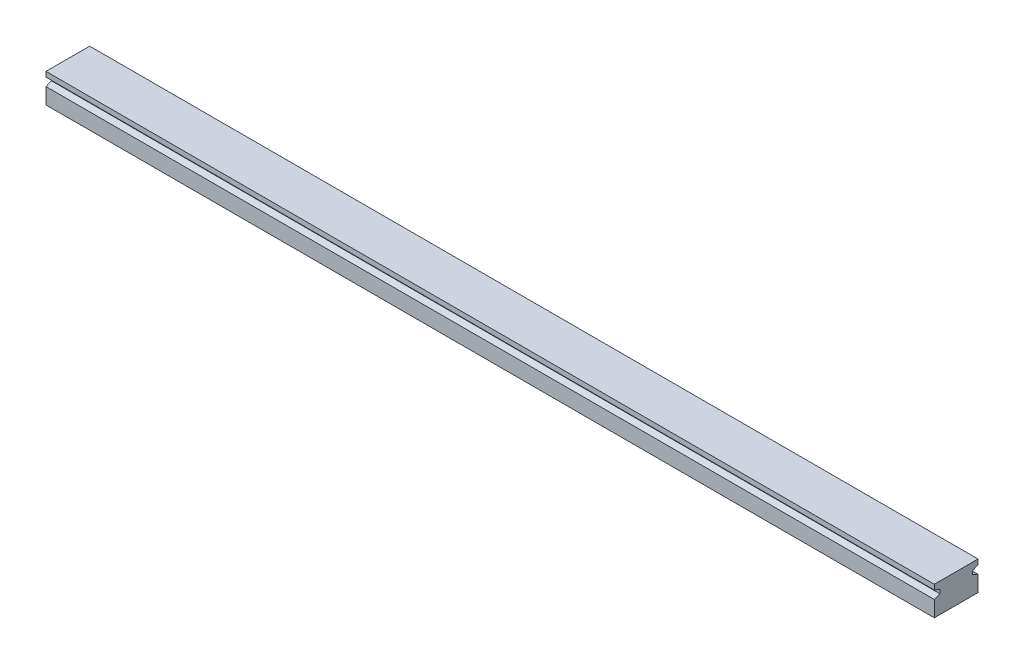
ISO-10303-21;
HEADER;
FILE_DESCRIPTION(('STEP AP214'),'2;1');
FILE_NAME('part.step','',(''),(''),'','','');
FILE_SCHEMA(('AUTOMOTIVE_DESIGN { 1 0 10303 214 1 1 1 1 }'));
ENDSEC;
DATA;
#1=APPLICATION_CONTEXT('core data for automotive mechanical design processes');
#2=APPLICATION_PROTOCOL_DEFINITION('international standard','automotive_design',2000,#1);
#3=PRODUCT_CONTEXT('',#1,'mechanical');
#4=PRODUCT('Part','Part','',(#3));
#5=PRODUCT_RELATED_PRODUCT_CATEGORY('part','',(#4));
#6=PRODUCT_DEFINITION_FORMATION('','',#4);
#7=PRODUCT_DEFINITION_CONTEXT('part definition',#1,'design');
#8=PRODUCT_DEFINITION('design','',#6,#7);
#9=PRODUCT_DEFINITION_SHAPE('','',#8);
#10=(LENGTH_UNIT() NAMED_UNIT(*) SI_UNIT(.MILLI.,.METRE.));
#11=(NAMED_UNIT(*) PLANE_ANGLE_UNIT() SI_UNIT($,.RADIAN.));
#12=(NAMED_UNIT(*) SI_UNIT($,.STERADIAN.) SOLID_ANGLE_UNIT());
#13=UNCERTAINTY_MEASURE_WITH_UNIT(LENGTH_MEASURE(1.E-05),#10,'distance_accuracy_value','');
#14=(GEOMETRIC_REPRESENTATION_CONTEXT(3) GLOBAL_UNCERTAINTY_ASSIGNED_CONTEXT((#13)) GLOBAL_UNIT_ASSIGNED_CONTEXT((#10,
#11,#12)) REPRESENTATION_CONTEXT('',''));
#15=CARTESIAN_POINT('',(0.,0.,0.));
#16=DIRECTION('',(0.,0.,1.));
#17=DIRECTION('',(1.,0.,0.));
#18=AXIS2_PLACEMENT_3D('',#15,#16,#17);
#19=CARTESIAN_POINT('',(-140.,4.,-6.));
#20=DIRECTION('',(0.,0.,1.));
#21=DIRECTION('',(1.,0.,0.));
#22=AXIS2_PLACEMENT_3D('',#19,#20,#21);
#23=PLANE('',#22);
#24=DIRECTION('',(0.,1.,0.));
#25=VECTOR('',#24,1.);
#26=CARTESIAN_POINT('',(122.,-4.,-6.));
#27=LINE('',#26,#25);
#28=CARTESIAN_POINT('',(122.,2.625,-6.));
#29=VERTEX_POINT('',#28);
#30=CARTESIAN_POINT('',(122.,4.,-6.));
#31=VERTEX_POINT('',#30);
#32=EDGE_CURVE('E143',#29,#31,#27,.T.);
#33=ORIENTED_EDGE('',*,*,#32,.F.);
#34=DIRECTION('',(-1.,0.,0.));
#35=VECTOR('',#34,1.);
#36=CARTESIAN_POINT('',(140.,2.625,-6.));
#37=LINE('',#36,#35);
#38=CARTESIAN_POINT('',(-122.,2.625,-6.));
#39=VERTEX_POINT('',#38);
#40=EDGE_CURVE('E220',#29,#39,#37,.T.);
#41=ORIENTED_EDGE('',*,*,#40,.T.);
#42=DIRECTION('',(0.,1.,0.));
#43=VECTOR('',#42,1.);
#44=CARTESIAN_POINT('',(-122.,-4.,-6.));
#45=LINE('',#44,#43);
#46=CARTESIAN_POINT('',(-122.,4.,-6.));
#47=VERTEX_POINT('',#46);
#48=EDGE_CURVE('E289',#39,#47,#45,.T.);
#49=ORIENTED_EDGE('',*,*,#48,.T.);
#50=DIRECTION('',(-1.,0.,0.));
#51=VECTOR('',#50,1.);
#52=CARTESIAN_POINT('',(-140.,4.,-6.));
#53=LINE('',#52,#51);
#54=EDGE_CURVE('E165',#31,#47,#53,.T.);
#55=ORIENTED_EDGE('',*,*,#54,.F.);
#56=EDGE_LOOP('',(#33,#41,#49,#55));
#57=FACE_BOUND('',#56,.T.);
#58=ADVANCED_FACE('F45',(#57),#23,.F.);
#59=CARTESIAN_POINT('',(-140.,4.,6.));
#60=DIRECTION('',(0.,0.,-1.));
#61=DIRECTION('',(-1.,0.,0.));
#62=AXIS2_PLACEMENT_3D('',#59,#60,#61);
#63=PLANE('',#62);
#64=DIRECTION('',(0.,1.,0.));
#65=VECTOR('',#64,1.);
#66=CARTESIAN_POINT('',(122.,-4.,6.));
#67=LINE('',#66,#65);
#68=CARTESIAN_POINT('',(122.,2.625,6.));
#69=VERTEX_POINT('',#68);
#70=CARTESIAN_POINT('',(122.,4.,6.));
#71=VERTEX_POINT('',#70);
#72=EDGE_CURVE('E154',#69,#71,#67,.T.);
#73=ORIENTED_EDGE('',*,*,#72,.T.);
#74=DIRECTION('',(1.,0.,0.));
#75=VECTOR('',#74,1.);
#76=CARTESIAN_POINT('',(-140.,4.,6.));
#77=LINE('',#76,#75);
#78=CARTESIAN_POINT('',(-122.,4.,6.));
#79=VERTEX_POINT('',#78);
#80=EDGE_CURVE('E171',#79,#71,#77,.T.);
#81=ORIENTED_EDGE('',*,*,#80,.F.);
#82=DIRECTION('',(0.,1.,0.));
#83=VECTOR('',#82,1.);
#84=CARTESIAN_POINT('',(-122.,-4.,6.));
#85=LINE('',#84,#83);
#86=CARTESIAN_POINT('',(-122.,2.625,6.));
#87=VERTEX_POINT('',#86);
#88=EDGE_CURVE('E260',#87,#79,#85,.T.);
#89=ORIENTED_EDGE('',*,*,#88,.F.);
#90=DIRECTION('',(-1.,0.,0.));
#91=VECTOR('',#90,1.);
#92=CARTESIAN_POINT('',(140.,2.625,6.));
#93=LINE('',#92,#91);
#94=EDGE_CURVE('E249',#69,#87,#93,.T.);
#95=ORIENTED_EDGE('',*,*,#94,.F.);
#96=EDGE_LOOP('',(#73,#81,#89,#95));
#97=FACE_BOUND('',#96,.T.);
#98=ADVANCED_FACE('F205',(#97),#63,.F.);
#99=CARTESIAN_POINT('',(0.,4.,0.));
#100=DIRECTION('',(0.,-1.,0.));
#101=DIRECTION('',(0.,0.,-1.));
#102=AXIS2_PLACEMENT_3D('',#99,#100,#101);
#103=PLANE('',#102);
#104=DIRECTION('',(0.,0.,-1.));
#105=VECTOR('',#104,1.);
#106=CARTESIAN_POINT('',(122.,4.,-6.));
#107=LINE('',#106,#105);
#108=EDGE_CURVE('E144',#71,#31,#107,.T.);
#109=ORIENTED_EDGE('',*,*,#108,.T.);
#110=ORIENTED_EDGE('',*,*,#54,.T.);
#111=DIRECTION('',(0.,0.,-1.));
#112=VECTOR('',#111,1.);
#113=CARTESIAN_POINT('',(-122.,4.,-6.));
#114=LINE('',#113,#112);
#115=EDGE_CURVE('E256',#79,#47,#114,.T.);
#116=ORIENTED_EDGE('',*,*,#115,.F.);
#117=ORIENTED_EDGE('',*,*,#80,.T.);
#118=EDGE_LOOP('',(#109,#110,#116,#117));
#119=FACE_BOUND('',#118,.T.);
#120=ADVANCED_FACE('F196',(#119),#103,.F.);
#121=CARTESIAN_POINT('',(0.,-4.,0.));
#122=DIRECTION('',(0.,-1.,0.));
#123=DIRECTION('',(0.,0.,-1.));
#124=AXIS2_PLACEMENT_3D('',#121,#122,#123);
#125=PLANE('',#124);
#126=CARTESIAN_POINT('',(25.,-4.,0.));
#127=DIRECTION('',(0.,1.,0.));
#128=DIRECTION('',(0.,0.,1.));
#129=AXIS2_PLACEMENT_3D('',#126,#127,#128);
#130=CIRCLE('',#129,2.);
#131=CARTESIAN_POINT('',(25.,-4.,2.));
#132=VERTEX_POINT('',#131);
#133=EDGE_CURVE('E168',#132,#132,#130,.T.);
#134=ORIENTED_EDGE('',*,*,#133,.T.);
#135=EDGE_LOOP('',(#134));
#136=FACE_BOUND('',#135,.T.);
#137=CARTESIAN_POINT('',(-25.,-4.,0.));
#138=DIRECTION('',(0.,1.,0.));
#139=DIRECTION('',(0.,0.,1.));
#140=AXIS2_PLACEMENT_3D('',#137,#138,#139);
#141=CIRCLE('',#140,2.);
#142=CARTESIAN_POINT('',(-25.,-4.,2.));
#143=VERTEX_POINT('',#142);
#144=EDGE_CURVE('E161',#143,#143,#141,.T.);
#145=ORIENTED_EDGE('',*,*,#144,.T.);
#146=EDGE_LOOP('',(#145));
#147=FACE_BOUND('',#146,.T.);
#148=DIRECTION('',(-1.,0.,0.));
#149=VECTOR('',#148,1.);
#150=CARTESIAN_POINT('',(-140.,-4.,-6.));
#151=LINE('',#150,#149);
#152=CARTESIAN_POINT('',(122.,-4.,-6.));
#153=VERTEX_POINT('',#152);
#154=CARTESIAN_POINT('',(-122.,-4.,-6.));
#155=VERTEX_POINT('',#154);
#156=EDGE_CURVE('E150',#153,#155,#151,.T.);
#157=ORIENTED_EDGE('',*,*,#156,.F.);
#158=DIRECTION('',(0.,0.,-1.));
#159=VECTOR('',#158,1.);
#160=CARTESIAN_POINT('',(122.,-4.,-6.));
#161=LINE('',#160,#159);
#162=CARTESIAN_POINT('',(122.,-4.,6.));
#163=VERTEX_POINT('',#162);
#164=EDGE_CURVE('E134',#163,#153,#161,.T.);
#165=ORIENTED_EDGE('',*,*,#164,.F.);
#166=DIRECTION('',(1.,0.,0.));
#167=VECTOR('',#166,1.);
#168=CARTESIAN_POINT('',(-140.,-4.,6.));
#169=LINE('',#168,#167);
#170=CARTESIAN_POINT('',(-122.,-4.,6.));
#171=VERTEX_POINT('',#170);
#172=EDGE_CURVE('E160',#171,#163,#169,.T.);
#173=ORIENTED_EDGE('',*,*,#172,.F.);
#174=DIRECTION('',(0.,0.,-1.));
#175=VECTOR('',#174,1.);
#176=CARTESIAN_POINT('',(-122.,-4.,-6.));
#177=LINE('',#176,#175);
#178=EDGE_CURVE('E158',#171,#155,#177,.T.);
#179=ORIENTED_EDGE('',*,*,#178,.T.);
#180=EDGE_LOOP('',(#157,#165,#173,#179));
#181=FACE_BOUND('',#180,.T.);
#182=ADVANCED_FACE('F157',(#136,#147,#181),#125,.T.);
#183=CARTESIAN_POINT('',(122.,0.374999999999999,-6.));
#184=VERTEX_POINT('',#183);
#185=EDGE_CURVE('E60',#153,#184,#27,.T.);
#186=ORIENTED_EDGE('',*,*,#185,.F.);
#187=ORIENTED_EDGE('',*,*,#156,.T.);
#188=CARTESIAN_POINT('',(-122.,0.374999999999999,-6.));
#189=VERTEX_POINT('',#188);
#190=EDGE_CURVE('E285',#155,#189,#45,.T.);
#191=ORIENTED_EDGE('',*,*,#190,.T.);
#192=DIRECTION('',(-1.,0.,0.));
#193=VECTOR('',#192,1.);
#194=CARTESIAN_POINT('',(140.,0.374999999999999,-6.));
#195=LINE('',#194,#193);
#196=EDGE_CURVE('E152',#184,#189,#195,.T.);
#197=ORIENTED_EDGE('',*,*,#196,.F.);
#198=EDGE_LOOP('',(#186,#187,#191,#197));
#199=FACE_BOUND('',#198,.T.);
#200=ADVANCED_FACE('F148',(#199),#23,.F.);
#201=CARTESIAN_POINT('',(122.,0.374999999999998,6.));
#202=VERTEX_POINT('',#201);
#203=EDGE_CURVE('E137',#163,#202,#67,.T.);
#204=ORIENTED_EDGE('',*,*,#203,.T.);
#205=DIRECTION('',(-1.,0.,0.));
#206=VECTOR('',#205,1.);
#207=CARTESIAN_POINT('',(140.,0.374999999999999,6.));
#208=LINE('',#207,#206);
#209=CARTESIAN_POINT('',(-122.,0.374999999999999,6.));
#210=VERTEX_POINT('',#209);
#211=EDGE_CURVE('E311',#202,#210,#208,.T.);
#212=ORIENTED_EDGE('',*,*,#211,.T.);
#213=EDGE_CURVE('E290',#171,#210,#85,.T.);
#214=ORIENTED_EDGE('',*,*,#213,.F.);
#215=ORIENTED_EDGE('',*,*,#172,.T.);
#216=EDGE_LOOP('',(#204,#212,#214,#215));
#217=FACE_BOUND('',#216,.T.);
#218=ADVANCED_FACE('F204',(#217),#63,.F.);
#219=CARTESIAN_POINT('',(140.,2.,4.5));
#220=DIRECTION('',(0.,0.923076923076923,-0.384615384615385));
#221=DIRECTION('',(0.,0.384615384615385,0.923076923076923));
#222=AXIS2_PLACEMENT_3D('',#219,#220,#221);
#223=PLANE('',#222);
#224=DIRECTION('',(0.,-0.384615384615385,-0.923076923076923));
#225=VECTOR('',#224,1.);
#226=CARTESIAN_POINT('',(122.,2.,4.5));
#227=LINE('',#226,#225);
#228=CARTESIAN_POINT('',(122.,2.,4.5));
#229=VERTEX_POINT('',#228);
#230=EDGE_CURVE('E278',#69,#229,#227,.T.);
#231=ORIENTED_EDGE('',*,*,#230,.F.);
#232=ORIENTED_EDGE('',*,*,#94,.T.);
#233=DIRECTION('',(0.,-0.384615384615385,-0.923076923076923));
#234=VECTOR('',#233,1.);
#235=CARTESIAN_POINT('',(-122.,2.,4.5));
#236=LINE('',#235,#234);
#237=CARTESIAN_POINT('',(-122.,2.,4.5));
#238=VERTEX_POINT('',#237);
#239=EDGE_CURVE('E247',#87,#238,#236,.T.);
#240=ORIENTED_EDGE('',*,*,#239,.T.);
#241=DIRECTION('',(-1.,0.,0.));
#242=VECTOR('',#241,1.);
#243=CARTESIAN_POINT('',(140.,2.,4.5));
#244=LINE('',#243,#242);
#245=EDGE_CURVE('E233',#229,#238,#244,.T.);
#246=ORIENTED_EDGE('',*,*,#245,.F.);
#247=EDGE_LOOP('',(#231,#232,#240,#246));
#248=FACE_BOUND('',#247,.T.);
#249=ADVANCED_FACE('F329',(#248),#223,.F.);
#250=CARTESIAN_POINT('',(140.,0.374999999999999,6.));
#251=DIRECTION('',(0.,-0.923076923076923,-0.384615384615385));
#252=DIRECTION('',(0.,0.384615384615385,-0.923076923076923));
#253=AXIS2_PLACEMENT_3D('',#250,#251,#252);
#254=PLANE('',#253);
#255=DIRECTION('',(0.,-0.384615384615385,0.923076923076923));
#256=VECTOR('',#255,1.);
#257=CARTESIAN_POINT('',(122.,0.374999999999999,6.));
#258=LINE('',#257,#256);
#259=CARTESIAN_POINT('',(122.,0.999999999999999,4.5));
#260=VERTEX_POINT('',#259);
#261=EDGE_CURVE('E275',#260,#202,#258,.T.);
#262=ORIENTED_EDGE('',*,*,#261,.F.);
#263=DIRECTION('',(-1.,0.,0.));
#264=VECTOR('',#263,1.);
#265=CARTESIAN_POINT('',(140.,0.999999999999999,4.5));
#266=LINE('',#265,#264);
#267=CARTESIAN_POINT('',(-122.,0.999999999999999,4.5));
#268=VERTEX_POINT('',#267);
#269=EDGE_CURVE('E237',#260,#268,#266,.T.);
#270=ORIENTED_EDGE('',*,*,#269,.T.);
#271=DIRECTION('',(0.,-0.384615384615385,0.923076923076923));
#272=VECTOR('',#271,1.);
#273=CARTESIAN_POINT('',(-122.,0.374999999999999,6.));
#274=LINE('',#273,#272);
#275=EDGE_CURVE('E302',#268,#210,#274,.T.);
#276=ORIENTED_EDGE('',*,*,#275,.T.);
#277=ORIENTED_EDGE('',*,*,#211,.F.);
#278=EDGE_LOOP('',(#262,#270,#276,#277));
#279=FACE_BOUND('',#278,.T.);
#280=ADVANCED_FACE('F318',(#279),#254,.F.);
#281=CARTESIAN_POINT('',(140.,0.999999999999999,4.5));
#282=DIRECTION('',(0.,0.,-1.));
#283=DIRECTION('',(0.,1.,0.));
#284=AXIS2_PLACEMENT_3D('',#281,#282,#283);
#285=PLANE('',#284);
#286=DIRECTION('',(0.,-1.,0.));
#287=VECTOR('',#286,1.);
#288=CARTESIAN_POINT('',(122.,0.999999999999999,4.5));
#289=LINE('',#288,#287);
#290=EDGE_CURVE('E272',#229,#260,#289,.T.);
#291=ORIENTED_EDGE('',*,*,#290,.F.);
#292=ORIENTED_EDGE('',*,*,#245,.T.);
#293=DIRECTION('',(0.,-1.,0.));
#294=VECTOR('',#293,1.);
#295=CARTESIAN_POINT('',(-122.,0.999999999999999,4.5));
#296=LINE('',#295,#294);
#297=EDGE_CURVE('E298',#238,#268,#296,.T.);
#298=ORIENTED_EDGE('',*,*,#297,.T.);
#299=ORIENTED_EDGE('',*,*,#269,.F.);
#300=EDGE_LOOP('',(#291,#292,#298,#299));
#301=FACE_BOUND('',#300,.T.);
#302=ADVANCED_FACE('F326',(#301),#285,.F.);
#303=CARTESIAN_POINT('',(140.,2.,-4.5));
#304=DIRECTION('',(0.,0.923076923076923,0.384615384615385));
#305=DIRECTION('',(0.,-0.384615384615385,0.923076923076923));
#306=AXIS2_PLACEMENT_3D('',#303,#304,#305);
#307=PLANE('',#306);
#308=DIRECTION('',(0.,0.384615384615385,-0.923076923076923));
#309=VECTOR('',#308,1.);
#310=CARTESIAN_POINT('',(122.,2.,-4.5));
#311=LINE('',#310,#309);
#312=CARTESIAN_POINT('',(122.,2.,-4.5));
#313=VERTEX_POINT('',#312);
#314=EDGE_CURVE('E228',#313,#29,#311,.T.);
#315=ORIENTED_EDGE('',*,*,#314,.F.);
#316=DIRECTION('',(-1.,0.,0.));
#317=VECTOR('',#316,1.);
#318=CARTESIAN_POINT('',(140.,2.,-4.5));
#319=LINE('',#318,#317);
#320=CARTESIAN_POINT('',(-122.,2.,-4.5));
#321=VERTEX_POINT('',#320);
#322=EDGE_CURVE('E244',#313,#321,#319,.T.);
#323=ORIENTED_EDGE('',*,*,#322,.T.);
#324=DIRECTION('',(0.,0.384615384615385,-0.923076923076923));
#325=VECTOR('',#324,1.);
#326=CARTESIAN_POINT('',(-122.,2.,-4.5));
#327=LINE('',#326,#325);
#328=EDGE_CURVE('E231',#321,#39,#327,.T.);
#329=ORIENTED_EDGE('',*,*,#328,.T.);
#330=ORIENTED_EDGE('',*,*,#40,.F.);
#331=EDGE_LOOP('',(#315,#323,#329,#330));
#332=FACE_BOUND('',#331,.T.);
#333=ADVANCED_FACE('F227',(#332),#307,.F.);
#334=CARTESIAN_POINT('',(140.,2.,-4.5));
#335=DIRECTION('',(0.,0.,1.));
#336=DIRECTION('',(0.,-1.,0.));
#337=AXIS2_PLACEMENT_3D('',#334,#335,#336);
#338=PLANE('',#337);
#339=DIRECTION('',(0.,1.,0.));
#340=VECTOR('',#339,1.);
#341=CARTESIAN_POINT('',(122.,2.,-4.5));
#342=LINE('',#341,#340);
#343=CARTESIAN_POINT('',(122.,0.999999999999999,-4.5));
#344=VERTEX_POINT('',#343);
#345=EDGE_CURVE('E265',#344,#313,#342,.T.);
#346=ORIENTED_EDGE('',*,*,#345,.F.);
#347=DIRECTION('',(-1.,0.,0.));
#348=VECTOR('',#347,1.);
#349=CARTESIAN_POINT('',(140.,0.999999999999999,-4.5));
#350=LINE('',#349,#348);
#351=CARTESIAN_POINT('',(-122.,0.999999999999999,-4.5));
#352=VERTEX_POINT('',#351);
#353=EDGE_CURVE('E68',#344,#352,#350,.T.);
#354=ORIENTED_EDGE('',*,*,#353,.T.);
#355=DIRECTION('',(0.,1.,0.));
#356=VECTOR('',#355,1.);
#357=CARTESIAN_POINT('',(-122.,2.,-4.5));
#358=LINE('',#357,#356);
#359=EDGE_CURVE('E288',#352,#321,#358,.T.);
#360=ORIENTED_EDGE('',*,*,#359,.T.);
#361=ORIENTED_EDGE('',*,*,#322,.F.);
#362=EDGE_LOOP('',(#346,#354,#360,#361));
#363=FACE_BOUND('',#362,.T.);
#364=ADVANCED_FACE('F333',(#363),#338,.F.);
#365=CARTESIAN_POINT('',(140.,0.374999999999999,-6.));
#366=DIRECTION('',(0.,-0.923076923076923,0.384615384615385));
#367=DIRECTION('',(0.,-0.384615384615385,-0.923076923076923));
#368=AXIS2_PLACEMENT_3D('',#365,#366,#367);
#369=PLANE('',#368);
#370=DIRECTION('',(0.,0.384615384615385,0.923076923076923));
#371=VECTOR('',#370,1.);
#372=CARTESIAN_POINT('',(122.,0.374999999999999,-6.));
#373=LINE('',#372,#371);
#374=EDGE_CURVE('E178',#184,#344,#373,.T.);
#375=ORIENTED_EDGE('',*,*,#374,.F.);
#376=ORIENTED_EDGE('',*,*,#196,.T.);
#377=DIRECTION('',(0.,0.384615384615385,0.923076923076923));
#378=VECTOR('',#377,1.);
#379=CARTESIAN_POINT('',(-122.,0.374999999999999,-6.));
#380=LINE('',#379,#378);
#381=EDGE_CURVE('E174',#189,#352,#380,.T.);
#382=ORIENTED_EDGE('',*,*,#381,.T.);
#383=ORIENTED_EDGE('',*,*,#353,.F.);
#384=EDGE_LOOP('',(#375,#376,#382,#383));
#385=FACE_BOUND('',#384,.T.);
#386=ADVANCED_FACE('F335',(#385),#369,.F.);
#387=CARTESIAN_POINT('',(25.,4.,0.));
#388=DIRECTION('',(0.,-1.,0.));
#389=DIRECTION('',(0.,0.,-1.));
#390=AXIS2_PLACEMENT_3D('',#387,#388,#389);
#391=CYLINDRICAL_SURFACE('',#390,2.);
#392=CARTESIAN_POINT('',(25.,0.,0.));
#393=DIRECTION('',(0.,-1.,0.));
#394=DIRECTION('',(0.,0.,-1.));
#395=AXIS2_PLACEMENT_3D('',#392,#393,#394);
#396=CIRCLE('',#395,2.);
#397=CARTESIAN_POINT('',(25.,0.,-2.));
#398=VERTEX_POINT('',#397);
#399=EDGE_CURVE('E11',#398,#398,#396,.T.);
#400=ORIENTED_EDGE('',*,*,#399,.F.);
#401=EDGE_LOOP('',(#400));
#402=FACE_BOUND('',#401,.T.);
#403=ORIENTED_EDGE('',*,*,#133,.F.);
#404=EDGE_LOOP('',(#403));
#405=FACE_BOUND('',#404,.T.);
#406=ADVANCED_FACE('F191',(#402,#405),#391,.F.);
#407=CARTESIAN_POINT('',(-25.,4.,0.));
#408=DIRECTION('',(0.,-1.,0.));
#409=DIRECTION('',(0.,0.,-1.));
#410=AXIS2_PLACEMENT_3D('',#407,#408,#409);
#411=CYLINDRICAL_SURFACE('',#410,2.);
#412=CARTESIAN_POINT('',(-25.,0.,0.));
#413=DIRECTION('',(0.,-1.,0.));
#414=DIRECTION('',(0.,0.,-1.));
#415=AXIS2_PLACEMENT_3D('',#412,#413,#414);
#416=CIRCLE('',#415,2.);
#417=CARTESIAN_POINT('',(-25.,0.,-2.));
#418=VERTEX_POINT('',#417);
#419=EDGE_CURVE('E53',#418,#418,#416,.T.);
#420=ORIENTED_EDGE('',*,*,#419,.F.);
#421=EDGE_LOOP('',(#420));
#422=FACE_BOUND('',#421,.T.);
#423=ORIENTED_EDGE('',*,*,#144,.F.);
#424=EDGE_LOOP('',(#423));
#425=FACE_BOUND('',#424,.T.);
#426=ADVANCED_FACE('F187',(#422,#425),#411,.F.);
#427=CARTESIAN_POINT('',(-122.,-4.,-6.));
#428=DIRECTION('',(1.,0.,0.));
#429=DIRECTION('',(0.,0.,-1.));
#430=AXIS2_PLACEMENT_3D('',#427,#428,#429);
#431=PLANE('',#430);
#432=ORIENTED_EDGE('',*,*,#88,.T.);
#433=ORIENTED_EDGE('',*,*,#115,.T.);
#434=ORIENTED_EDGE('',*,*,#48,.F.);
#435=ORIENTED_EDGE('',*,*,#328,.F.);
#436=ORIENTED_EDGE('',*,*,#359,.F.);
#437=ORIENTED_EDGE('',*,*,#381,.F.);
#438=ORIENTED_EDGE('',*,*,#190,.F.);
#439=ORIENTED_EDGE('',*,*,#178,.F.);
#440=ORIENTED_EDGE('',*,*,#213,.T.);
#441=ORIENTED_EDGE('',*,*,#275,.F.);
#442=ORIENTED_EDGE('',*,*,#297,.F.);
#443=ORIENTED_EDGE('',*,*,#239,.F.);
#444=EDGE_LOOP('',(#432,#433,#434,#435,#436,#437,#438,#439,#440,#441,#442,#443));
#445=FACE_BOUND('',#444,.T.);
#446=ADVANCED_FACE('F190',(#445),#431,.F.);
#447=CARTESIAN_POINT('',(122.,-4.,-6.));
#448=DIRECTION('',(1.,0.,0.));
#449=DIRECTION('',(0.,0.,-1.));
#450=AXIS2_PLACEMENT_3D('',#447,#448,#449);
#451=PLANE('',#450);
#452=ORIENTED_EDGE('',*,*,#230,.T.);
#453=ORIENTED_EDGE('',*,*,#290,.T.);
#454=ORIENTED_EDGE('',*,*,#261,.T.);
#455=ORIENTED_EDGE('',*,*,#203,.F.);
#456=ORIENTED_EDGE('',*,*,#164,.T.);
#457=ORIENTED_EDGE('',*,*,#185,.T.);
#458=ORIENTED_EDGE('',*,*,#374,.T.);
#459=ORIENTED_EDGE('',*,*,#345,.T.);
#460=ORIENTED_EDGE('',*,*,#314,.T.);
#461=ORIENTED_EDGE('',*,*,#32,.T.);
#462=ORIENTED_EDGE('',*,*,#108,.F.);
#463=ORIENTED_EDGE('',*,*,#72,.F.);
#464=EDGE_LOOP('',(#452,#453,#454,#455,#456,#457,#458,#459,#460,#461,#462,#463));
#465=FACE_BOUND('',#464,.T.);
#466=ADVANCED_FACE('F135',(#465),#451,.T.);
#467=CARTESIAN_POINT('',(-25.,0.,0.));
#468=DIRECTION('',(0.,-1.,0.));
#469=DIRECTION('',(0.,0.,-1.));
#470=AXIS2_PLACEMENT_3D('',#467,#468,#469);
#471=PLANE('',#470);
#472=ORIENTED_EDGE('',*,*,#419,.T.);
#473=EDGE_LOOP('',(#472));
#474=FACE_BOUND('',#473,.T.);
#475=CARTESIAN_POINT('',(-25.,0.,0.));
#476=DIRECTION('',(0.,-1.,0.));
#477=DIRECTION('',(0.,0.,-1.));
#478=AXIS2_PLACEMENT_3D('',#475,#476,#477);
#479=CIRCLE('',#478,1.5);
#480=CARTESIAN_POINT('',(-25.,0.,-1.5));
#481=VERTEX_POINT('',#480);
#482=EDGE_CURVE('E379',#481,#481,#479,.T.);
#483=ORIENTED_EDGE('',*,*,#482,.F.);
#484=EDGE_LOOP('',(#483));
#485=FACE_BOUND('',#484,.T.);
#486=ADVANCED_FACE('F184',(#474,#485),#471,.T.);
#487=CARTESIAN_POINT('',(-25.,0.,0.));
#488=DIRECTION('',(0.,1.,0.));
#489=DIRECTION('',(0.,0.,1.));
#490=AXIS2_PLACEMENT_3D('',#487,#488,#489);
#491=CYLINDRICAL_SURFACE('',#490,1.5);
#492=ORIENTED_EDGE('',*,*,#482,.T.);
#493=EDGE_LOOP('',(#492));
#494=FACE_BOUND('',#493,.T.);
#495=CARTESIAN_POINT('',(-25.,2.,0.));
#496=DIRECTION('',(0.,-1.,0.));
#497=DIRECTION('',(0.,0.,-1.));
#498=AXIS2_PLACEMENT_3D('',#495,#496,#497);
#499=CIRCLE('',#498,1.5);
#500=CARTESIAN_POINT('',(-25.,2.,-1.5));
#501=VERTEX_POINT('',#500);
#502=EDGE_CURVE('E376',#501,#501,#499,.T.);
#503=ORIENTED_EDGE('',*,*,#502,.F.);
#504=EDGE_LOOP('',(#503));
#505=FACE_BOUND('',#504,.T.);
#506=ADVANCED_FACE('F388',(#494,#505),#491,.F.);
#507=CARTESIAN_POINT('',(-25.,2.,0.));
#508=DIRECTION('',(0.,1.,0.));
#509=DIRECTION('',(0.,0.,1.));
#510=AXIS2_PLACEMENT_3D('',#507,#508,#509);
#511=PLANE('',#510);
#512=ORIENTED_EDGE('',*,*,#502,.T.);
#513=EDGE_LOOP('',(#512));
#514=FACE_BOUND('',#513,.T.);
#515=ADVANCED_FACE('F365',(#514),#511,.F.);
#516=CARTESIAN_POINT('',(25.,0.,0.));
#517=DIRECTION('',(0.,-1.,0.));
#518=DIRECTION('',(0.,0.,-1.));
#519=AXIS2_PLACEMENT_3D('',#516,#517,#518);
#520=PLANE('',#519);
#521=ORIENTED_EDGE('',*,*,#399,.T.);
#522=EDGE_LOOP('',(#521));
#523=FACE_BOUND('',#522,.T.);
#524=CARTESIAN_POINT('',(25.,0.,0.));
#525=DIRECTION('',(0.,-1.,0.));
#526=DIRECTION('',(0.,0.,-1.));
#527=AXIS2_PLACEMENT_3D('',#524,#525,#526);
#528=CIRCLE('',#527,1.5);
#529=CARTESIAN_POINT('',(25.,0.,-1.5));
#530=VERTEX_POINT('',#529);
#531=EDGE_CURVE('E369',#530,#530,#528,.T.);
#532=ORIENTED_EDGE('',*,*,#531,.F.);
#533=EDGE_LOOP('',(#532));
#534=FACE_BOUND('',#533,.T.);
#535=ADVANCED_FACE('F361',(#523,#534),#520,.T.);
#536=CARTESIAN_POINT('',(25.,0.,0.));
#537=DIRECTION('',(0.,1.,0.));
#538=DIRECTION('',(0.,0.,1.));
#539=AXIS2_PLACEMENT_3D('',#536,#537,#538);
#540=CYLINDRICAL_SURFACE('',#539,1.5);
#541=ORIENTED_EDGE('',*,*,#531,.T.);
#542=EDGE_LOOP('',(#541));
#543=FACE_BOUND('',#542,.T.);
#544=CARTESIAN_POINT('',(25.,2.,0.));
#545=DIRECTION('',(0.,-1.,0.));
#546=DIRECTION('',(0.,0.,-1.));
#547=AXIS2_PLACEMENT_3D('',#544,#545,#546);
#548=CIRCLE('',#547,1.5);
#549=CARTESIAN_POINT('',(25.,2.,-1.5));
#550=VERTEX_POINT('',#549);
#551=EDGE_CURVE('E372',#550,#550,#548,.T.);
#552=ORIENTED_EDGE('',*,*,#551,.F.);
#553=EDGE_LOOP('',(#552));
#554=FACE_BOUND('',#553,.T.);
#555=ADVANCED_FACE('F364',(#543,#554),#540,.F.);
#556=CARTESIAN_POINT('',(25.,2.,0.));
#557=DIRECTION('',(0.,1.,0.));
#558=DIRECTION('',(0.,0.,1.));
#559=AXIS2_PLACEMENT_3D('',#556,#557,#558);
#560=PLANE('',#559);
#561=ORIENTED_EDGE('',*,*,#551,.T.);
#562=EDGE_LOOP('',(#561));
#563=FACE_BOUND('',#562,.T.);
#564=ADVANCED_FACE('F403',(#563),#560,.F.);
#565=CLOSED_SHELL('',(#58,#98,#120,#182,#200,#218,#249,#280,#302,#333,#364,#386,#406,#426,#446,
#466,#486,#506,#515,#535,#555,#564));
#566=MANIFOLD_SOLID_BREP('B2',#565);
#567=ADVANCED_BREP_SHAPE_REPRESENTATION('',(#18,#566),#14);
#568=SHAPE_DEFINITION_REPRESENTATION(#9,#567);
ENDSEC;
END-ISO-10303-21;
